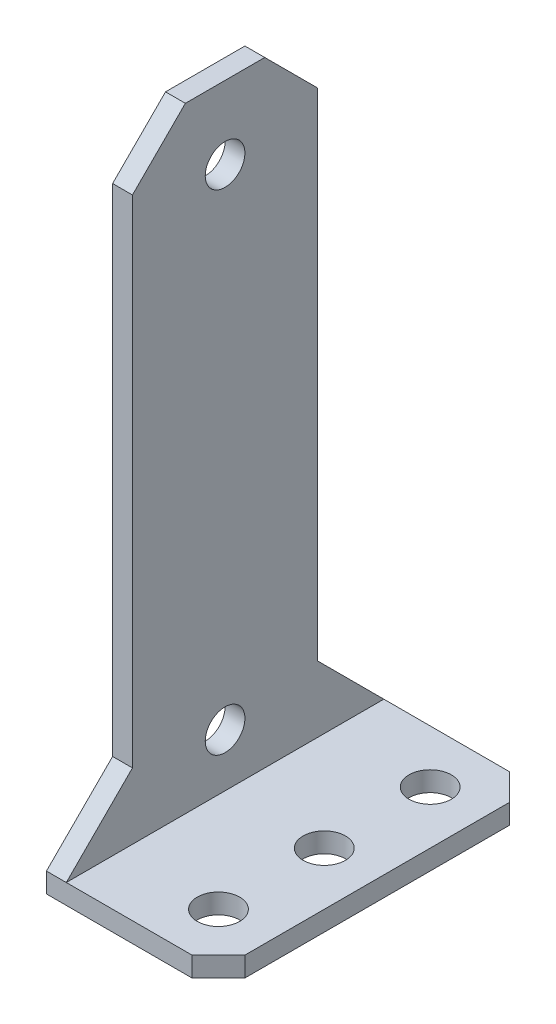
ISO-10303-21;
HEADER;
FILE_DESCRIPTION(('STEP AP214'),'2;1');
FILE_NAME('part.step','',(''),(''),'','','');
FILE_SCHEMA(('AUTOMOTIVE_DESIGN { 1 0 10303 214 1 1 1 1 }'));
ENDSEC;
DATA;
#1=APPLICATION_CONTEXT('core data for automotive mechanical design processes');
#2=APPLICATION_PROTOCOL_DEFINITION('international standard','automotive_design',2000,#1);
#3=PRODUCT_CONTEXT('',#1,'mechanical');
#4=PRODUCT('Part','Part','',(#3));
#5=PRODUCT_RELATED_PRODUCT_CATEGORY('part','',(#4));
#6=PRODUCT_DEFINITION_FORMATION('','',#4);
#7=PRODUCT_DEFINITION_CONTEXT('part definition',#1,'design');
#8=PRODUCT_DEFINITION('design','',#6,#7);
#9=PRODUCT_DEFINITION_SHAPE('','',#8);
#10=(LENGTH_UNIT() NAMED_UNIT(*) SI_UNIT(.MILLI.,.METRE.));
#11=(NAMED_UNIT(*) PLANE_ANGLE_UNIT() SI_UNIT($,.RADIAN.));
#12=(NAMED_UNIT(*) SI_UNIT($,.STERADIAN.) SOLID_ANGLE_UNIT());
#13=UNCERTAINTY_MEASURE_WITH_UNIT(LENGTH_MEASURE(1.E-05),#10,'distance_accuracy_value','');
#14=(GEOMETRIC_REPRESENTATION_CONTEXT(3) GLOBAL_UNCERTAINTY_ASSIGNED_CONTEXT((#13)) GLOBAL_UNIT_ASSIGNED_CONTEXT((#10,
#11,#12)) REPRESENTATION_CONTEXT('',''));
#15=CARTESIAN_POINT('',(0.,0.,0.));
#16=DIRECTION('',(0.,0.,1.));
#17=DIRECTION('',(1.,0.,0.));
#18=AXIS2_PLACEMENT_3D('',#15,#16,#17);
#19=CARTESIAN_POINT('',(1.5,48.,12.));
#20=DIRECTION('',(-1.,0.,0.));
#21=DIRECTION('',(0.,0.,1.));
#22=AXIS2_PLACEMENT_3D('',#19,#20,#21);
#23=PLANE('',#22);
#24=CARTESIAN_POINT('',(1.5,42.5,0.));
#25=DIRECTION('',(-1.,0.,0.));
#26=DIRECTION('',(0.,0.,1.));
#27=AXIS2_PLACEMENT_3D('',#24,#25,#26);
#28=CIRCLE('',#27,1.5);
#29=CARTESIAN_POINT('',(1.5,42.5,1.5));
#30=VERTEX_POINT('',#29);
#31=EDGE_CURVE('E315',#30,#30,#28,.T.);
#32=ORIENTED_EDGE('',*,*,#31,.T.);
#33=EDGE_LOOP('',(#32));
#34=FACE_BOUND('',#33,.T.);
#35=CARTESIAN_POINT('',(1.5,5.50000000000001,0.));
#36=DIRECTION('',(-1.,0.,0.));
#37=DIRECTION('',(0.,0.,1.));
#38=AXIS2_PLACEMENT_3D('',#35,#36,#37);
#39=CIRCLE('',#38,1.5);
#40=CARTESIAN_POINT('',(1.5,5.50000000000001,1.50000000000001));
#41=VERTEX_POINT('',#40);
#42=EDGE_CURVE('E310',#41,#41,#39,.T.);
#43=ORIENTED_EDGE('',*,*,#42,.T.);
#44=EDGE_LOOP('',(#43));
#45=FACE_BOUND('',#44,.T.);
#46=DIRECTION('',(0.,0.,-1.));
#47=VECTOR('',#46,1.);
#48=CARTESIAN_POINT('',(1.5,48.,12.));
#49=LINE('',#48,#47);
#50=CARTESIAN_POINT('',(1.5,48.,3.));
#51=VERTEX_POINT('',#50);
#52=CARTESIAN_POINT('',(1.5,48.,-3.));
#53=VERTEX_POINT('',#52);
#54=EDGE_CURVE('E158',#51,#53,#49,.T.);
#55=ORIENTED_EDGE('',*,*,#54,.F.);
#56=DIRECTION('',(0.,0.707106781186549,-0.707106781186546));
#57=VECTOR('',#56,1.);
#58=CARTESIAN_POINT('',(1.5,48.,3.));
#59=LINE('',#58,#57);
#60=CARTESIAN_POINT('',(1.5,44.,7.));
#61=VERTEX_POINT('',#60);
#62=EDGE_CURVE('E194',#51,#61,#59,.F.);
#63=ORIENTED_EDGE('',*,*,#62,.T.);
#64=DIRECTION('',(0.,-1.,0.));
#65=VECTOR('',#64,1.);
#66=CARTESIAN_POINT('',(1.5,48.,7.));
#67=LINE('',#66,#65);
#68=CARTESIAN_POINT('',(1.5,6.49999999999998,7.));
#69=VERTEX_POINT('',#68);
#70=EDGE_CURVE('E218',#61,#69,#67,.T.);
#71=ORIENTED_EDGE('',*,*,#70,.T.);
#72=DIRECTION('',(0.,0.707106781186544,-0.707106781186551));
#73=VECTOR('',#72,1.);
#74=CARTESIAN_POINT('',(1.5,24.7499999999998,-11.25));
#75=LINE('',#74,#73);
#76=CARTESIAN_POINT('',(1.5,1.5,12.));
#77=VERTEX_POINT('',#76);
#78=EDGE_CURVE('E134',#69,#77,#75,.F.);
#79=ORIENTED_EDGE('',*,*,#78,.T.);
#80=DIRECTION('',(0.,0.,-1.));
#81=VECTOR('',#80,1.);
#82=CARTESIAN_POINT('',(1.5,1.5,12.));
#83=LINE('',#82,#81);
#84=CARTESIAN_POINT('',(1.5,1.5,-12.));
#85=VERTEX_POINT('',#84);
#86=EDGE_CURVE('E161',#77,#85,#83,.T.);
#87=ORIENTED_EDGE('',*,*,#86,.T.);
#88=DIRECTION('',(0.,0.707106781186551,0.707106781186544));
#89=VECTOR('',#88,1.);
#90=CARTESIAN_POINT('',(1.5,36.7500000000002,23.2499999999999));
#91=LINE('',#90,#89);
#92=CARTESIAN_POINT('',(1.5,6.50000000000003,-7.));
#93=VERTEX_POINT('',#92);
#94=EDGE_CURVE('E11',#85,#93,#91,.T.);
#95=ORIENTED_EDGE('',*,*,#94,.T.);
#96=DIRECTION('',(0.,-1.,0.));
#97=VECTOR('',#96,1.);
#98=CARTESIAN_POINT('',(1.5,48.,-7.));
#99=LINE('',#98,#97);
#100=CARTESIAN_POINT('',(1.5,44.,-7.));
#101=VERTEX_POINT('',#100);
#102=EDGE_CURVE('E321',#101,#93,#99,.T.);
#103=ORIENTED_EDGE('',*,*,#102,.F.);
#104=DIRECTION('',(0.,0.707106781186547,0.707106781186548));
#105=VECTOR('',#104,1.);
#106=CARTESIAN_POINT('',(1.5,44.,-7.));
#107=LINE('',#106,#105);
#108=EDGE_CURVE('E192',#101,#53,#107,.T.);
#109=ORIENTED_EDGE('',*,*,#108,.T.);
#110=EDGE_LOOP('',(#55,#63,#71,#79,#87,#95,#103,#109));
#111=FACE_BOUND('',#110,.T.);
#112=ADVANCED_FACE('F33',(#34,#45,#111),#23,.F.);
#113=CARTESIAN_POINT('',(0.,48.,12.));
#114=DIRECTION('',(0.,-1.,0.));
#115=DIRECTION('',(0.,0.,-1.));
#116=AXIS2_PLACEMENT_3D('',#113,#114,#115);
#117=PLANE('',#116);
#118=DIRECTION('',(0.,0.,-1.));
#119=VECTOR('',#118,1.);
#120=CARTESIAN_POINT('',(0.,48.,12.));
#121=LINE('',#120,#119);
#122=CARTESIAN_POINT('',(0.,48.,3.));
#123=VERTEX_POINT('',#122);
#124=CARTESIAN_POINT('',(0.,48.,-3.));
#125=VERTEX_POINT('',#124);
#126=EDGE_CURVE('E154',#123,#125,#121,.T.);
#127=ORIENTED_EDGE('',*,*,#126,.F.);
#128=DIRECTION('',(1.,0.,0.));
#129=VECTOR('',#128,1.);
#130=CARTESIAN_POINT('',(0.,48.,3.));
#131=LINE('',#130,#129);
#132=EDGE_CURVE('E189',#123,#51,#131,.T.);
#133=ORIENTED_EDGE('',*,*,#132,.T.);
#134=ORIENTED_EDGE('',*,*,#54,.T.);
#135=DIRECTION('',(-1.,0.,0.));
#136=VECTOR('',#135,1.);
#137=CARTESIAN_POINT('',(0.,48.,-3.));
#138=LINE('',#137,#136);
#139=EDGE_CURVE('E187',#53,#125,#138,.T.);
#140=ORIENTED_EDGE('',*,*,#139,.T.);
#141=EDGE_LOOP('',(#127,#133,#134,#140));
#142=FACE_BOUND('',#141,.T.);
#143=ADVANCED_FACE('F267',(#142),#117,.F.);
#144=CARTESIAN_POINT('',(0.,0.,12.));
#145=DIRECTION('',(1.,0.,0.));
#146=DIRECTION('',(0.,0.,-1.));
#147=AXIS2_PLACEMENT_3D('',#144,#145,#146);
#148=PLANE('',#147);
#149=CARTESIAN_POINT('',(0.,42.5,0.));
#150=DIRECTION('',(-1.,0.,0.));
#151=DIRECTION('',(0.,0.,1.));
#152=AXIS2_PLACEMENT_3D('',#149,#150,#151);
#153=CIRCLE('',#152,1.5);
#154=CARTESIAN_POINT('',(0.,42.5,1.5));
#155=VERTEX_POINT('',#154);
#156=EDGE_CURVE('E318',#155,#155,#153,.T.);
#157=ORIENTED_EDGE('',*,*,#156,.F.);
#158=EDGE_LOOP('',(#157));
#159=FACE_BOUND('',#158,.T.);
#160=CARTESIAN_POINT('',(0.,5.50000000000001,0.));
#161=DIRECTION('',(-1.,0.,0.));
#162=DIRECTION('',(0.,0.,1.));
#163=AXIS2_PLACEMENT_3D('',#160,#161,#162);
#164=CIRCLE('',#163,1.5);
#165=CARTESIAN_POINT('',(0.,5.50000000000001,1.50000000000001));
#166=VERTEX_POINT('',#165);
#167=EDGE_CURVE('E317',#166,#166,#164,.T.);
#168=ORIENTED_EDGE('',*,*,#167,.F.);
#169=EDGE_LOOP('',(#168));
#170=FACE_BOUND('',#169,.T.);
#171=DIRECTION('',(0.,-1.,0.));
#172=VECTOR('',#171,1.);
#173=CARTESIAN_POINT('',(0.,0.,12.));
#174=LINE('',#173,#172);
#175=CARTESIAN_POINT('',(0.,1.5,12.));
#176=VERTEX_POINT('',#175);
#177=CARTESIAN_POINT('',(0.,0.,12.));
#178=VERTEX_POINT('',#177);
#179=EDGE_CURVE('E155',#176,#178,#174,.T.);
#180=ORIENTED_EDGE('',*,*,#179,.F.);
#181=DIRECTION('',(0.,-0.707106781186544,0.707106781186551));
#182=VECTOR('',#181,1.);
#183=CARTESIAN_POINT('',(0.,0.750000000000024,12.75));
#184=LINE('',#183,#182);
#185=CARTESIAN_POINT('',(0.,6.49999999999998,6.99999999999998));
#186=VERTEX_POINT('',#185);
#187=EDGE_CURVE('E210',#176,#186,#184,.F.);
#188=ORIENTED_EDGE('',*,*,#187,.T.);
#189=DIRECTION('',(0.,1.,0.));
#190=VECTOR('',#189,1.);
#191=CARTESIAN_POINT('',(0.,42.5,7.));
#192=LINE('',#191,#190);
#193=CARTESIAN_POINT('',(0.,44.,7.));
#194=VERTEX_POINT('',#193);
#195=EDGE_CURVE('E326',#186,#194,#192,.T.);
#196=ORIENTED_EDGE('',*,*,#195,.T.);
#197=DIRECTION('',(0.,-0.707106781186549,0.707106781186546));
#198=VECTOR('',#197,1.);
#199=CARTESIAN_POINT('',(0.,48.,3.));
#200=LINE('',#199,#198);
#201=EDGE_CURVE('E201',#194,#123,#200,.F.);
#202=ORIENTED_EDGE('',*,*,#201,.T.);
#203=ORIENTED_EDGE('',*,*,#126,.T.);
#204=DIRECTION('',(0.,-0.707106781186547,-0.707106781186548));
#205=VECTOR('',#204,1.);
#206=CARTESIAN_POINT('',(0.,44.,-7.));
#207=LINE('',#206,#205);
#208=CARTESIAN_POINT('',(0.,44.,-7.));
#209=VERTEX_POINT('',#208);
#210=EDGE_CURVE('E199',#125,#209,#207,.T.);
#211=ORIENTED_EDGE('',*,*,#210,.T.);
#212=DIRECTION('',(0.,-1.,0.));
#213=VECTOR('',#212,1.);
#214=CARTESIAN_POINT('',(0.,0.,-7.));
#215=LINE('',#214,#213);
#216=CARTESIAN_POINT('',(0.,6.50000000000003,-7.));
#217=VERTEX_POINT('',#216);
#218=EDGE_CURVE('E133',#209,#217,#215,.T.);
#219=ORIENTED_EDGE('',*,*,#218,.T.);
#220=DIRECTION('',(0.,-0.707106781186551,-0.707106781186544));
#221=VECTOR('',#220,1.);
#222=CARTESIAN_POINT('',(0.,12.75,-0.750000000000119));
#223=LINE('',#222,#221);
#224=CARTESIAN_POINT('',(0.,1.5,-12.));
#225=VERTEX_POINT('',#224);
#226=EDGE_CURVE('E41',#217,#225,#223,.T.);
#227=ORIENTED_EDGE('',*,*,#226,.T.);
#228=DIRECTION('',(0.,-1.,0.));
#229=VECTOR('',#228,1.);
#230=CARTESIAN_POINT('',(0.,0.,-12.));
#231=LINE('',#230,#229);
#232=CARTESIAN_POINT('',(0.,0.,-12.));
#233=VERTEX_POINT('',#232);
#234=EDGE_CURVE('E130',#225,#233,#231,.T.);
#235=ORIENTED_EDGE('',*,*,#234,.T.);
#236=DIRECTION('',(0.,0.,-1.));
#237=VECTOR('',#236,1.);
#238=CARTESIAN_POINT('',(0.,0.,12.));
#239=LINE('',#238,#237);
#240=EDGE_CURVE('E152',#178,#233,#239,.T.);
#241=ORIENTED_EDGE('',*,*,#240,.F.);
#242=EDGE_LOOP('',(#180,#188,#196,#202,#203,#211,#219,#227,#235,#241));
#243=FACE_BOUND('',#242,.T.);
#244=ADVANCED_FACE('F128',(#159,#170,#243),#148,.F.);
#245=CARTESIAN_POINT('',(0.,0.,-12.));
#246=DIRECTION('',(0.,0.,1.));
#247=DIRECTION('',(1.,0.,0.));
#248=AXIS2_PLACEMENT_3D('',#245,#246,#247);
#249=PLANE('',#248);
#250=ORIENTED_EDGE('',*,*,#234,.F.);
#251=DIRECTION('',(-1.,0.,0.));
#252=VECTOR('',#251,1.);
#253=CARTESIAN_POINT('',(13.,1.5,-12.));
#254=LINE('',#253,#252);
#255=EDGE_CURVE('E140',#85,#225,#254,.T.);
#256=ORIENTED_EDGE('',*,*,#255,.F.);
#257=CARTESIAN_POINT('',(11.,1.5,-12.));
#258=VERTEX_POINT('',#257);
#259=EDGE_CURVE('E145',#258,#85,#254,.T.);
#260=ORIENTED_EDGE('',*,*,#259,.F.);
#261=DIRECTION('',(0.,-1.,0.));
#262=VECTOR('',#261,1.);
#263=CARTESIAN_POINT('',(11.,0.,-12.));
#264=LINE('',#263,#262);
#265=CARTESIAN_POINT('',(11.,0.,-12.));
#266=VERTEX_POINT('',#265);
#267=EDGE_CURVE('E178',#258,#266,#264,.T.);
#268=ORIENTED_EDGE('',*,*,#267,.T.);
#269=DIRECTION('',(1.,0.,0.));
#270=VECTOR('',#269,1.);
#271=CARTESIAN_POINT('',(0.,0.,-12.));
#272=LINE('',#271,#270);
#273=EDGE_CURVE('E143',#233,#266,#272,.T.);
#274=ORIENTED_EDGE('',*,*,#273,.F.);
#275=EDGE_LOOP('',(#250,#256,#260,#268,#274));
#276=FACE_BOUND('',#275,.T.);
#277=ADVANCED_FACE('F138',(#276),#249,.F.);
#278=CARTESIAN_POINT('',(0.,0.,12.));
#279=DIRECTION('',(0.,1.,0.));
#280=DIRECTION('',(0.,0.,1.));
#281=AXIS2_PLACEMENT_3D('',#278,#279,#280);
#282=PLANE('',#281);
#283=CARTESIAN_POINT('',(9.,0.,-8.));
#284=DIRECTION('',(0.,1.,0.));
#285=DIRECTION('',(0.,0.,1.));
#286=AXIS2_PLACEMENT_3D('',#283,#284,#285);
#287=CIRCLE('',#286,1.6);
#288=CARTESIAN_POINT('',(9.,0.,-6.4));
#289=VERTEX_POINT('',#288);
#290=EDGE_CURVE('E148',#289,#289,#287,.T.);
#291=ORIENTED_EDGE('',*,*,#290,.T.);
#292=EDGE_LOOP('',(#291));
#293=FACE_BOUND('',#292,.T.);
#294=CARTESIAN_POINT('',(9.,0.,8.));
#295=DIRECTION('',(0.,1.,0.));
#296=DIRECTION('',(0.,0.,1.));
#297=AXIS2_PLACEMENT_3D('',#294,#295,#296);
#298=CIRCLE('',#297,1.6);
#299=CARTESIAN_POINT('',(9.,0.,9.6));
#300=VERTEX_POINT('',#299);
#301=EDGE_CURVE('E295',#300,#300,#298,.T.);
#302=ORIENTED_EDGE('',*,*,#301,.T.);
#303=EDGE_LOOP('',(#302));
#304=FACE_BOUND('',#303,.T.);
#305=CARTESIAN_POINT('',(9.,0.,0.));
#306=DIRECTION('',(0.,1.,0.));
#307=DIRECTION('',(0.,0.,1.));
#308=AXIS2_PLACEMENT_3D('',#305,#306,#307);
#309=CIRCLE('',#308,1.6);
#310=CARTESIAN_POINT('',(9.,0.,1.6));
#311=VERTEX_POINT('',#310);
#312=EDGE_CURVE('E298',#311,#311,#309,.T.);
#313=ORIENTED_EDGE('',*,*,#312,.T.);
#314=EDGE_LOOP('',(#313));
#315=FACE_BOUND('',#314,.T.);
#316=ORIENTED_EDGE('',*,*,#273,.T.);
#317=DIRECTION('',(-0.707106781186548,0.,-0.707106781186548));
#318=VECTOR('',#317,1.);
#319=CARTESIAN_POINT('',(13.,0.,-10.));
#320=LINE('',#319,#318);
#321=CARTESIAN_POINT('',(13.,0.,-10.));
#322=VERTEX_POINT('',#321);
#323=EDGE_CURVE('E182',#266,#322,#320,.F.);
#324=ORIENTED_EDGE('',*,*,#323,.T.);
#325=DIRECTION('',(0.,0.,-1.));
#326=VECTOR('',#325,1.);
#327=CARTESIAN_POINT('',(13.,0.,12.));
#328=LINE('',#327,#326);
#329=CARTESIAN_POINT('',(13.,0.,10.));
#330=VERTEX_POINT('',#329);
#331=EDGE_CURVE('E166',#330,#322,#328,.T.);
#332=ORIENTED_EDGE('',*,*,#331,.F.);
#333=DIRECTION('',(-0.707106781186548,0.,0.707106781186548));
#334=VECTOR('',#333,1.);
#335=CARTESIAN_POINT('',(11.,0.,12.));
#336=LINE('',#335,#334);
#337=CARTESIAN_POINT('',(11.,0.,12.));
#338=VERTEX_POINT('',#337);
#339=EDGE_CURVE('E180',#330,#338,#336,.T.);
#340=ORIENTED_EDGE('',*,*,#339,.T.);
#341=DIRECTION('',(1.,0.,0.));
#342=VECTOR('',#341,1.);
#343=CARTESIAN_POINT('',(0.,0.,12.));
#344=LINE('',#343,#342);
#345=EDGE_CURVE('E144',#178,#338,#344,.T.);
#346=ORIENTED_EDGE('',*,*,#345,.F.);
#347=ORIENTED_EDGE('',*,*,#240,.T.);
#348=EDGE_LOOP('',(#316,#324,#332,#340,#346,#347));
#349=FACE_BOUND('',#348,.T.);
#350=ADVANCED_FACE('F237',(#293,#304,#315,#349),#282,.F.);
#351=CARTESIAN_POINT('',(13.,0.,12.));
#352=DIRECTION('',(-1.,0.,0.));
#353=DIRECTION('',(0.,0.,1.));
#354=AXIS2_PLACEMENT_3D('',#351,#352,#353);
#355=PLANE('',#354);
#356=ORIENTED_EDGE('',*,*,#331,.T.);
#357=DIRECTION('',(0.,1.,0.));
#358=VECTOR('',#357,1.);
#359=CARTESIAN_POINT('',(13.,0.,-10.));
#360=LINE('',#359,#358);
#361=CARTESIAN_POINT('',(13.,1.5,-10.));
#362=VERTEX_POINT('',#361);
#363=EDGE_CURVE('E171',#322,#362,#360,.T.);
#364=ORIENTED_EDGE('',*,*,#363,.T.);
#365=DIRECTION('',(0.,0.,-1.));
#366=VECTOR('',#365,1.);
#367=CARTESIAN_POINT('',(13.,1.5,12.));
#368=LINE('',#367,#366);
#369=CARTESIAN_POINT('',(13.,1.5,10.));
#370=VERTEX_POINT('',#369);
#371=EDGE_CURVE('E163',#370,#362,#368,.T.);
#372=ORIENTED_EDGE('',*,*,#371,.F.);
#373=DIRECTION('',(0.,-1.,0.));
#374=VECTOR('',#373,1.);
#375=CARTESIAN_POINT('',(13.,0.,10.));
#376=LINE('',#375,#374);
#377=EDGE_CURVE('E169',#370,#330,#376,.T.);
#378=ORIENTED_EDGE('',*,*,#377,.T.);
#379=EDGE_LOOP('',(#356,#364,#372,#378));
#380=FACE_BOUND('',#379,.T.);
#381=ADVANCED_FACE('F247',(#380),#355,.F.);
#382=CARTESIAN_POINT('',(13.,1.5,12.));
#383=DIRECTION('',(0.,-1.,0.));
#384=DIRECTION('',(0.,0.,-1.));
#385=AXIS2_PLACEMENT_3D('',#382,#383,#384);
#386=PLANE('',#385);
#387=CARTESIAN_POINT('',(9.,1.5,-8.));
#388=DIRECTION('',(0.,1.,0.));
#389=DIRECTION('',(0.,0.,1.));
#390=AXIS2_PLACEMENT_3D('',#387,#388,#389);
#391=CIRCLE('',#390,1.6);
#392=CARTESIAN_POINT('',(9.,1.5,-6.4));
#393=VERTEX_POINT('',#392);
#394=EDGE_CURVE('E307',#393,#393,#391,.T.);
#395=ORIENTED_EDGE('',*,*,#394,.F.);
#396=EDGE_LOOP('',(#395));
#397=FACE_BOUND('',#396,.T.);
#398=CARTESIAN_POINT('',(9.,1.5,8.));
#399=DIRECTION('',(0.,1.,0.));
#400=DIRECTION('',(0.,0.,1.));
#401=AXIS2_PLACEMENT_3D('',#398,#399,#400);
#402=CIRCLE('',#401,1.6);
#403=CARTESIAN_POINT('',(9.,1.5,9.6));
#404=VERTEX_POINT('',#403);
#405=EDGE_CURVE('E304',#404,#404,#402,.T.);
#406=ORIENTED_EDGE('',*,*,#405,.F.);
#407=EDGE_LOOP('',(#406));
#408=FACE_BOUND('',#407,.T.);
#409=ORIENTED_EDGE('',*,*,#86,.F.);
#410=DIRECTION('',(-1.,0.,0.));
#411=VECTOR('',#410,1.);
#412=CARTESIAN_POINT('',(13.,1.5,12.));
#413=LINE('',#412,#411);
#414=CARTESIAN_POINT('',(11.,1.5,12.));
#415=VERTEX_POINT('',#414);
#416=EDGE_CURVE('E225',#415,#77,#413,.T.);
#417=ORIENTED_EDGE('',*,*,#416,.F.);
#418=DIRECTION('',(0.707106781186548,0.,-0.707106781186548));
#419=VECTOR('',#418,1.);
#420=CARTESIAN_POINT('',(11.,1.5,12.));
#421=LINE('',#420,#419);
#422=EDGE_CURVE('E174',#415,#370,#421,.T.);
#423=ORIENTED_EDGE('',*,*,#422,.T.);
#424=ORIENTED_EDGE('',*,*,#371,.T.);
#425=DIRECTION('',(0.707106781186548,0.,0.707106781186548));
#426=VECTOR('',#425,1.);
#427=CARTESIAN_POINT('',(13.,1.5,-10.));
#428=LINE('',#427,#426);
#429=EDGE_CURVE('E176',#362,#258,#428,.F.);
#430=ORIENTED_EDGE('',*,*,#429,.T.);
#431=ORIENTED_EDGE('',*,*,#259,.T.);
#432=EDGE_LOOP('',(#409,#417,#423,#424,#430,#431));
#433=FACE_BOUND('',#432,.T.);
#434=CARTESIAN_POINT('',(9.,1.5,0.));
#435=DIRECTION('',(0.,1.,0.));
#436=DIRECTION('',(0.,0.,1.));
#437=AXIS2_PLACEMENT_3D('',#434,#435,#436);
#438=CIRCLE('',#437,1.6);
#439=CARTESIAN_POINT('',(9.,1.5,1.6));
#440=VERTEX_POINT('',#439);
#441=EDGE_CURVE('E300',#440,#440,#438,.T.);
#442=ORIENTED_EDGE('',*,*,#441,.F.);
#443=EDGE_LOOP('',(#442));
#444=FACE_BOUND('',#443,.T.);
#445=ADVANCED_FACE('F244',(#397,#408,#433,#444),#386,.F.);
#446=CARTESIAN_POINT('',(0.,0.,12.));
#447=DIRECTION('',(0.,0.,1.));
#448=DIRECTION('',(1.,0.,0.));
#449=AXIS2_PLACEMENT_3D('',#446,#447,#448);
#450=PLANE('',#449);
#451=ORIENTED_EDGE('',*,*,#416,.T.);
#452=EDGE_CURVE('E227',#77,#176,#413,.T.);
#453=ORIENTED_EDGE('',*,*,#452,.T.);
#454=ORIENTED_EDGE('',*,*,#179,.T.);
#455=ORIENTED_EDGE('',*,*,#345,.T.);
#456=DIRECTION('',(0.,1.,0.));
#457=VECTOR('',#456,1.);
#458=CARTESIAN_POINT('',(11.,1.5,12.));
#459=LINE('',#458,#457);
#460=EDGE_CURVE('E184',#338,#415,#459,.T.);
#461=ORIENTED_EDGE('',*,*,#460,.T.);
#462=EDGE_LOOP('',(#451,#453,#454,#455,#461));
#463=FACE_BOUND('',#462,.T.);
#464=ADVANCED_FACE('F226',(#463),#450,.T.);
#465=CARTESIAN_POINT('',(9.,-43.7,0.));
#466=DIRECTION('',(0.,1.,0.));
#467=DIRECTION('',(0.,0.,1.));
#468=AXIS2_PLACEMENT_3D('',#465,#466,#467);
#469=CYLINDRICAL_SURFACE('',#468,1.6);
#470=ORIENTED_EDGE('',*,*,#441,.T.);
#471=EDGE_LOOP('',(#470));
#472=FACE_BOUND('',#471,.T.);
#473=ORIENTED_EDGE('',*,*,#312,.F.);
#474=EDGE_LOOP('',(#473));
#475=FACE_BOUND('',#474,.T.);
#476=ADVANCED_FACE('F359',(#472,#475),#469,.F.);
#477=CARTESIAN_POINT('',(9.,-43.7,8.));
#478=DIRECTION('',(0.,1.,0.));
#479=DIRECTION('',(0.,0.,1.));
#480=AXIS2_PLACEMENT_3D('',#477,#478,#479);
#481=CYLINDRICAL_SURFACE('',#480,1.6);
#482=ORIENTED_EDGE('',*,*,#405,.T.);
#483=EDGE_LOOP('',(#482));
#484=FACE_BOUND('',#483,.T.);
#485=ORIENTED_EDGE('',*,*,#301,.F.);
#486=EDGE_LOOP('',(#485));
#487=FACE_BOUND('',#486,.T.);
#488=ADVANCED_FACE('F262',(#484,#487),#481,.F.);
#489=CARTESIAN_POINT('',(9.,-43.7,-8.));
#490=DIRECTION('',(0.,1.,0.));
#491=DIRECTION('',(0.,0.,1.));
#492=AXIS2_PLACEMENT_3D('',#489,#490,#491);
#493=CYLINDRICAL_SURFACE('',#492,1.6);
#494=ORIENTED_EDGE('',*,*,#394,.T.);
#495=EDGE_LOOP('',(#494));
#496=FACE_BOUND('',#495,.T.);
#497=ORIENTED_EDGE('',*,*,#290,.F.);
#498=EDGE_LOOP('',(#497));
#499=FACE_BOUND('',#498,.T.);
#500=ADVANCED_FACE('F254',(#496,#499),#493,.F.);
#501=CARTESIAN_POINT('',(13.,0.,-10.));
#502=DIRECTION('',(-0.707106781186547,0.,0.707106781186547));
#503=DIRECTION('',(0.,1.,0.));
#504=AXIS2_PLACEMENT_3D('',#501,#502,#503);
#505=PLANE('',#504);
#506=ORIENTED_EDGE('',*,*,#323,.F.);
#507=ORIENTED_EDGE('',*,*,#267,.F.);
#508=ORIENTED_EDGE('',*,*,#429,.F.);
#509=ORIENTED_EDGE('',*,*,#363,.F.);
#510=EDGE_LOOP('',(#506,#507,#508,#509));
#511=FACE_BOUND('',#510,.T.);
#512=ADVANCED_FACE('F251',(#511),#505,.F.);
#513=CARTESIAN_POINT('',(11.,0.,12.));
#514=DIRECTION('',(0.707106781186547,0.,0.707106781186547));
#515=DIRECTION('',(0.,-1.,0.));
#516=AXIS2_PLACEMENT_3D('',#513,#514,#515);
#517=PLANE('',#516);
#518=ORIENTED_EDGE('',*,*,#339,.F.);
#519=ORIENTED_EDGE('',*,*,#377,.F.);
#520=ORIENTED_EDGE('',*,*,#422,.F.);
#521=ORIENTED_EDGE('',*,*,#460,.F.);
#522=EDGE_LOOP('',(#518,#519,#520,#521));
#523=FACE_BOUND('',#522,.T.);
#524=ADVANCED_FACE('F242',(#523),#517,.T.);
#525=CARTESIAN_POINT('',(13.,42.5,0.));
#526=DIRECTION('',(-1.,0.,0.));
#527=DIRECTION('',(0.,0.,1.));
#528=AXIS2_PLACEMENT_3D('',#525,#526,#527);
#529=CYLINDRICAL_SURFACE('',#528,1.5);
#530=CARTESIAN_POINT('',(0.,42.5,1.5));
#531=CARTESIAN_POINT('',(0.015625,42.5,1.5));
#532=CARTESIAN_POINT('',(0.03125,42.5,1.5));
#533=CARTESIAN_POINT('',(0.0625000000000001,42.5,1.5));
#534=CARTESIAN_POINT('',(0.0781250000000001,42.5,1.5));
#535=CARTESIAN_POINT('',(0.109375,42.5,1.5));
#536=CARTESIAN_POINT('',(0.125,42.5,1.5));
#537=CARTESIAN_POINT('',(0.15625,42.5,1.5));
#538=CARTESIAN_POINT('',(0.171875,42.5,1.5));
#539=CARTESIAN_POINT('',(0.203125,42.5,1.5));
#540=CARTESIAN_POINT('',(0.21875,42.5,1.5));
#541=CARTESIAN_POINT('',(0.25,42.5,1.5));
#542=CARTESIAN_POINT('',(0.265625,42.5,1.5));
#543=CARTESIAN_POINT('',(0.296875,42.5,1.5));
#544=CARTESIAN_POINT('',(0.3125,42.5,1.5));
#545=CARTESIAN_POINT('',(0.34375,42.5,1.5));
#546=CARTESIAN_POINT('',(0.359375,42.5,1.5));
#547=CARTESIAN_POINT('',(0.390625,42.5,1.5));
#548=CARTESIAN_POINT('',(0.40625,42.5,1.5));
#549=CARTESIAN_POINT('',(0.4375,42.5,1.5));
#550=CARTESIAN_POINT('',(0.453125,42.5,1.5));
#551=CARTESIAN_POINT('',(0.484375,42.5,1.5));
#552=CARTESIAN_POINT('',(0.5,42.5,1.5));
#553=CARTESIAN_POINT('',(0.53125,42.5,1.5));
#554=CARTESIAN_POINT('',(0.546875,42.5,1.5));
#555=CARTESIAN_POINT('',(0.578125000000001,42.5,1.5));
#556=CARTESIAN_POINT('',(0.593750000000001,42.5,1.5));
#557=CARTESIAN_POINT('',(0.625000000000001,42.5,1.5));
#558=CARTESIAN_POINT('',(0.640625000000001,42.5,1.5));
#559=CARTESIAN_POINT('',(0.671875000000001,42.5,1.5));
#560=CARTESIAN_POINT('',(0.687500000000001,42.5,1.5));
#561=CARTESIAN_POINT('',(0.718750000000001,42.5,1.5));
#562=CARTESIAN_POINT('',(0.734375000000001,42.5,1.5));
#563=CARTESIAN_POINT('',(0.765625000000001,42.5,1.5));
#564=CARTESIAN_POINT('',(0.781250000000001,42.5,1.5));
#565=CARTESIAN_POINT('',(0.812500000000001,42.5,1.5));
#566=CARTESIAN_POINT('',(0.828125000000001,42.5,1.5));
#567=CARTESIAN_POINT('',(0.859375000000001,42.5,1.5));
#568=CARTESIAN_POINT('',(0.875000000000001,42.5,1.5));
#569=CARTESIAN_POINT('',(0.906250000000001,42.5,1.5));
#570=CARTESIAN_POINT('',(0.921875000000001,42.5,1.5));
#571=CARTESIAN_POINT('',(0.953125000000001,42.5,1.5));
#572=CARTESIAN_POINT('',(0.968750000000001,42.5,1.5));
#573=CARTESIAN_POINT('',(1.,42.5,1.5));
#574=CARTESIAN_POINT('',(1.015625,42.5,1.5));
#575=CARTESIAN_POINT('',(1.046875,42.5,1.5));
#576=CARTESIAN_POINT('',(1.0625,42.5,1.5));
#577=CARTESIAN_POINT('',(1.09375,42.5,1.5));
#578=CARTESIAN_POINT('',(1.109375,42.5,1.5));
#579=CARTESIAN_POINT('',(1.140625,42.5,1.5));
#580=CARTESIAN_POINT('',(1.15625,42.5,1.5));
#581=CARTESIAN_POINT('',(1.1875,42.5,1.5));
#582=CARTESIAN_POINT('',(1.203125,42.5,1.5));
#583=CARTESIAN_POINT('',(1.234375,42.5,1.5));
#584=CARTESIAN_POINT('',(1.25,42.5,1.5));
#585=CARTESIAN_POINT('',(1.28125,42.5,1.5));
#586=CARTESIAN_POINT('',(1.296875,42.5,1.5));
#587=CARTESIAN_POINT('',(1.328125,42.5,1.5));
#588=CARTESIAN_POINT('',(1.34375,42.5,1.5));
#589=CARTESIAN_POINT('',(1.375,42.5,1.5));
#590=CARTESIAN_POINT('',(1.390625,42.5,1.5));
#591=CARTESIAN_POINT('',(1.421875,42.5,1.5));
#592=CARTESIAN_POINT('',(1.4375,42.5,1.5));
#593=CARTESIAN_POINT('',(1.46875,42.5,1.5));
#594=CARTESIAN_POINT('',(1.484375,42.5,1.5));
#595=CARTESIAN_POINT('',(1.5,42.5,1.5));
#596=B_SPLINE_CURVE_WITH_KNOTS('',3,(#530,#531,#532,#533,#534,#535,#536,#537,#538,#539,#540,
#541,#542,#543,#544,#545,#546,#547,#548,#549,#550,#551,#552,#553,#554,#555,#556,#557,#558,#559,
#560,#561,#562,#563,#564,#565,#566,#567,#568,#569,#570,#571,#572,#573,#574,#575,#576,#577,#578,
#579,#580,#581,#582,#583,#584,#585,#586,#587,#588,#589,#590,#591,#592,#593,#594,#595),
.UNSPECIFIED.,.F.,.F.,(4,2,2,2,2,2,2,2,2,2,2,2,2,2,2,2,2,2,2,2,2,2,2,2,2,2,2,2,2,2,2,2,4),(0.,
0.046875,0.0937500000000001,0.140625,0.1875,0.234375,0.28125,0.328125,0.375,0.421875,0.46875,
0.515625,0.5625,0.609375000000001,0.656250000000001,0.703125000000001,0.750000000000001,
0.796875000000001,0.843750000000001,0.890625000000001,0.937500000000001,0.984375000000001,
1.03125,1.078125,1.125,1.171875,1.21875,1.265625,1.3125,1.359375,1.40625,1.453125,1.5),.UNSPECIFIED.);
#597=EDGE_CURVE('BSEAM260',#155,#30,#596,.T.);
#598=ORIENTED_EDGE('',*,*,#156,.T.);
#599=ORIENTED_EDGE('',*,*,#31,.F.);
#600=ORIENTED_EDGE('',*,*,#597,.T.);
#601=ORIENTED_EDGE('',*,*,#597,.F.);
#602=EDGE_LOOP('',(#598,#600,#599,#601));
#603=FACE_BOUND('',#602,.T.);
#604=ADVANCED_FACE('F260',(#603),#529,.F.);
#605=CARTESIAN_POINT('',(13.,5.50000000000001,0.));
#606=DIRECTION('',(-1.,0.,0.));
#607=DIRECTION('',(0.,0.,1.));
#608=AXIS2_PLACEMENT_3D('',#605,#606,#607);
#609=CYLINDRICAL_SURFACE('',#608,1.5);
#610=CARTESIAN_POINT('',(0.,5.50000000000001,1.50000000000001));
#611=CARTESIAN_POINT('',(0.015625,5.50000000000001,1.50000000000001));
#612=CARTESIAN_POINT('',(0.03125,5.50000000000001,1.50000000000001));
#613=CARTESIAN_POINT('',(0.0625000000000001,5.50000000000001,1.50000000000001));
#614=CARTESIAN_POINT('',(0.0781250000000001,5.50000000000001,1.50000000000001));
#615=CARTESIAN_POINT('',(0.109375,5.50000000000001,1.50000000000001));
#616=CARTESIAN_POINT('',(0.125,5.50000000000001,1.50000000000001));
#617=CARTESIAN_POINT('',(0.15625,5.50000000000001,1.50000000000001));
#618=CARTESIAN_POINT('',(0.171875,5.50000000000001,1.50000000000001));
#619=CARTESIAN_POINT('',(0.203125,5.50000000000001,1.50000000000001));
#620=CARTESIAN_POINT('',(0.21875,5.50000000000001,1.50000000000001));
#621=CARTESIAN_POINT('',(0.25,5.50000000000001,1.50000000000001));
#622=CARTESIAN_POINT('',(0.265625,5.50000000000001,1.50000000000001));
#623=CARTESIAN_POINT('',(0.296875,5.50000000000001,1.50000000000001));
#624=CARTESIAN_POINT('',(0.3125,5.50000000000001,1.50000000000001));
#625=CARTESIAN_POINT('',(0.34375,5.50000000000001,1.50000000000001));
#626=CARTESIAN_POINT('',(0.359375,5.50000000000001,1.50000000000001));
#627=CARTESIAN_POINT('',(0.390625,5.50000000000001,1.50000000000001));
#628=CARTESIAN_POINT('',(0.40625,5.50000000000001,1.50000000000001));
#629=CARTESIAN_POINT('',(0.4375,5.50000000000001,1.50000000000001));
#630=CARTESIAN_POINT('',(0.453125,5.50000000000001,1.50000000000001));
#631=CARTESIAN_POINT('',(0.484375,5.50000000000001,1.50000000000001));
#632=CARTESIAN_POINT('',(0.5,5.50000000000001,1.50000000000001));
#633=CARTESIAN_POINT('',(0.53125,5.50000000000001,1.50000000000001));
#634=CARTESIAN_POINT('',(0.546875,5.50000000000001,1.50000000000001));
#635=CARTESIAN_POINT('',(0.578125000000001,5.50000000000001,1.50000000000001));
#636=CARTESIAN_POINT('',(0.593750000000001,5.50000000000001,1.50000000000001));
#637=CARTESIAN_POINT('',(0.625000000000001,5.50000000000001,1.50000000000001));
#638=CARTESIAN_POINT('',(0.640625000000001,5.50000000000001,1.50000000000001));
#639=CARTESIAN_POINT('',(0.671875000000001,5.50000000000001,1.50000000000001));
#640=CARTESIAN_POINT('',(0.687500000000001,5.50000000000001,1.50000000000001));
#641=CARTESIAN_POINT('',(0.718750000000001,5.50000000000001,1.50000000000001));
#642=CARTESIAN_POINT('',(0.734375000000001,5.50000000000001,1.50000000000001));
#643=CARTESIAN_POINT('',(0.765625000000001,5.50000000000001,1.50000000000001));
#644=CARTESIAN_POINT('',(0.781250000000001,5.50000000000001,1.50000000000001));
#645=CARTESIAN_POINT('',(0.812500000000001,5.50000000000001,1.50000000000001));
#646=CARTESIAN_POINT('',(0.828125000000001,5.50000000000001,1.50000000000001));
#647=CARTESIAN_POINT('',(0.859375000000001,5.50000000000001,1.50000000000001));
#648=CARTESIAN_POINT('',(0.875000000000001,5.50000000000001,1.50000000000001));
#649=CARTESIAN_POINT('',(0.906250000000001,5.50000000000001,1.50000000000001));
#650=CARTESIAN_POINT('',(0.921875000000001,5.50000000000001,1.50000000000001));
#651=CARTESIAN_POINT('',(0.953125000000001,5.50000000000001,1.50000000000001));
#652=CARTESIAN_POINT('',(0.968750000000001,5.50000000000001,1.50000000000001));
#653=CARTESIAN_POINT('',(1.,5.50000000000001,1.50000000000001));
#654=CARTESIAN_POINT('',(1.015625,5.50000000000001,1.50000000000001));
#655=CARTESIAN_POINT('',(1.046875,5.50000000000001,1.50000000000001));
#656=CARTESIAN_POINT('',(1.0625,5.50000000000001,1.50000000000001));
#657=CARTESIAN_POINT('',(1.09375,5.50000000000001,1.50000000000001));
#658=CARTESIAN_POINT('',(1.109375,5.50000000000001,1.50000000000001));
#659=CARTESIAN_POINT('',(1.140625,5.50000000000001,1.50000000000001));
#660=CARTESIAN_POINT('',(1.15625,5.50000000000001,1.50000000000001));
#661=CARTESIAN_POINT('',(1.1875,5.50000000000001,1.50000000000001));
#662=CARTESIAN_POINT('',(1.203125,5.50000000000001,1.50000000000001));
#663=CARTESIAN_POINT('',(1.234375,5.50000000000001,1.50000000000001));
#664=CARTESIAN_POINT('',(1.25,5.50000000000001,1.50000000000001));
#665=CARTESIAN_POINT('',(1.28125,5.50000000000001,1.50000000000001));
#666=CARTESIAN_POINT('',(1.296875,5.50000000000001,1.50000000000001));
#667=CARTESIAN_POINT('',(1.328125,5.50000000000001,1.50000000000001));
#668=CARTESIAN_POINT('',(1.34375,5.50000000000001,1.50000000000001));
#669=CARTESIAN_POINT('',(1.375,5.50000000000001,1.50000000000001));
#670=CARTESIAN_POINT('',(1.390625,5.50000000000001,1.50000000000001));
#671=CARTESIAN_POINT('',(1.421875,5.50000000000001,1.50000000000001));
#672=CARTESIAN_POINT('',(1.4375,5.50000000000001,1.50000000000001));
#673=CARTESIAN_POINT('',(1.46875,5.50000000000001,1.50000000000001));
#674=CARTESIAN_POINT('',(1.484375,5.50000000000001,1.50000000000001));
#675=CARTESIAN_POINT('',(1.5,5.50000000000001,1.50000000000001));
#676=B_SPLINE_CURVE_WITH_KNOTS('',3,(#610,#611,#612,#613,#614,#615,#616,#617,#618,#619,#620,
#621,#622,#623,#624,#625,#626,#627,#628,#629,#630,#631,#632,#633,#634,#635,#636,#637,#638,#639,
#640,#641,#642,#643,#644,#645,#646,#647,#648,#649,#650,#651,#652,#653,#654,#655,#656,#657,#658,
#659,#660,#661,#662,#663,#664,#665,#666,#667,#668,#669,#670,#671,#672,#673,#674,#675),
.UNSPECIFIED.,.F.,.F.,(4,2,2,2,2,2,2,2,2,2,2,2,2,2,2,2,2,2,2,2,2,2,2,2,2,2,2,2,2,2,2,2,4),(0.,
0.046875,0.0937500000000001,0.140625,0.1875,0.234375,0.28125,0.328125,0.375,0.421875,0.46875,
0.515625,0.5625,0.609375000000001,0.656250000000001,0.703125000000001,0.750000000000001,
0.796875000000001,0.843750000000001,0.890625000000001,0.937500000000001,0.984375000000001,
1.03125,1.078125,1.125,1.171875,1.21875,1.265625,1.3125,1.359375,1.40625,1.453125,1.5),.UNSPECIFIED.);
#677=EDGE_CURVE('BSEAM345',#166,#41,#676,.T.);
#678=ORIENTED_EDGE('',*,*,#167,.T.);
#679=ORIENTED_EDGE('',*,*,#42,.F.);
#680=ORIENTED_EDGE('',*,*,#677,.T.);
#681=ORIENTED_EDGE('',*,*,#677,.F.);
#682=EDGE_LOOP('',(#678,#680,#679,#681));
#683=FACE_BOUND('',#682,.T.);
#684=ADVANCED_FACE('F345',(#683),#609,.F.);
#685=CARTESIAN_POINT('',(10.,0.,-7.));
#686=DIRECTION('',(0.,0.,-1.));
#687=DIRECTION('',(0.,1.,0.));
#688=AXIS2_PLACEMENT_3D('',#685,#686,#687);
#689=PLANE('',#688);
#690=ORIENTED_EDGE('',*,*,#102,.T.);
#691=DIRECTION('',(-1.,0.,0.));
#692=VECTOR('',#691,1.);
#693=CARTESIAN_POINT('',(10.,6.50000000000003,-7.));
#694=LINE('',#693,#692);
#695=EDGE_CURVE('E208',#93,#217,#694,.T.);
#696=ORIENTED_EDGE('',*,*,#695,.T.);
#697=ORIENTED_EDGE('',*,*,#218,.F.);
#698=DIRECTION('',(1.,0.,0.));
#699=VECTOR('',#698,1.);
#700=CARTESIAN_POINT('',(1.5,44.,-7.));
#701=LINE('',#700,#699);
#702=EDGE_CURVE('E203',#209,#101,#701,.T.);
#703=ORIENTED_EDGE('',*,*,#702,.T.);
#704=EDGE_LOOP('',(#690,#696,#697,#703));
#705=FACE_BOUND('',#704,.T.);
#706=ADVANCED_FACE('F343',(#705),#689,.T.);
#707=CARTESIAN_POINT('',(10.,0.,7.));
#708=DIRECTION('',(0.,0.,-1.));
#709=DIRECTION('',(-1.,0.,0.));
#710=AXIS2_PLACEMENT_3D('',#707,#708,#709);
#711=PLANE('',#710);
#712=ORIENTED_EDGE('',*,*,#195,.F.);
#713=DIRECTION('',(1.,0.,0.));
#714=VECTOR('',#713,1.);
#715=CARTESIAN_POINT('',(1.5,6.49999999999998,7.));
#716=LINE('',#715,#714);
#717=EDGE_CURVE('E206',#186,#69,#716,.T.);
#718=ORIENTED_EDGE('',*,*,#717,.T.);
#719=ORIENTED_EDGE('',*,*,#70,.F.);
#720=DIRECTION('',(-1.,0.,0.));
#721=VECTOR('',#720,1.);
#722=CARTESIAN_POINT('',(10.,44.,7.));
#723=LINE('',#722,#721);
#724=EDGE_CURVE('E196',#61,#194,#723,.T.);
#725=ORIENTED_EDGE('',*,*,#724,.T.);
#726=EDGE_LOOP('',(#712,#718,#719,#725));
#727=FACE_BOUND('',#726,.T.);
#728=ADVANCED_FACE('F333',(#727),#711,.F.);
#729=CARTESIAN_POINT('',(0.,48.,3.));
#730=DIRECTION('',(0.,-0.707106781186546,-0.707106781186549));
#731=DIRECTION('',(1.,0.,0.));
#732=AXIS2_PLACEMENT_3D('',#729,#730,#731);
#733=PLANE('',#732);
#734=ORIENTED_EDGE('',*,*,#201,.F.);
#735=ORIENTED_EDGE('',*,*,#724,.F.);
#736=ORIENTED_EDGE('',*,*,#62,.F.);
#737=ORIENTED_EDGE('',*,*,#132,.F.);
#738=EDGE_LOOP('',(#734,#735,#736,#737));
#739=FACE_BOUND('',#738,.T.);
#740=ADVANCED_FACE('F336',(#739),#733,.F.);
#741=CARTESIAN_POINT('',(10.,44.,-7.));
#742=DIRECTION('',(0.,0.707106781186548,-0.707106781186547));
#743=DIRECTION('',(-1.,0.,0.));
#744=AXIS2_PLACEMENT_3D('',#741,#742,#743);
#745=PLANE('',#744);
#746=ORIENTED_EDGE('',*,*,#210,.F.);
#747=ORIENTED_EDGE('',*,*,#139,.F.);
#748=ORIENTED_EDGE('',*,*,#108,.F.);
#749=ORIENTED_EDGE('',*,*,#702,.F.);
#750=EDGE_LOOP('',(#746,#747,#748,#749));
#751=FACE_BOUND('',#750,.T.);
#752=ADVANCED_FACE('F341',(#751),#745,.T.);
#753=CARTESIAN_POINT('',(13.,1.5,12.));
#754=DIRECTION('',(0.,0.707106781186551,0.707106781186544));
#755=DIRECTION('',(1.,0.,0.));
#756=AXIS2_PLACEMENT_3D('',#753,#754,#755);
#757=PLANE('',#756);
#758=ORIENTED_EDGE('',*,*,#78,.F.);
#759=ORIENTED_EDGE('',*,*,#717,.F.);
#760=ORIENTED_EDGE('',*,*,#187,.F.);
#761=ORIENTED_EDGE('',*,*,#452,.F.);
#762=EDGE_LOOP('',(#758,#759,#760,#761));
#763=FACE_BOUND('',#762,.T.);
#764=ADVANCED_FACE('F232',(#763),#757,.T.);
#765=CARTESIAN_POINT('',(10.,6.50000000000003,-7.));
#766=DIRECTION('',(0.,-0.707106781186544,0.707106781186551));
#767=DIRECTION('',(-1.,0.,0.));
#768=AXIS2_PLACEMENT_3D('',#765,#766,#767);
#769=PLANE('',#768);
#770=ORIENTED_EDGE('',*,*,#94,.F.);
#771=ORIENTED_EDGE('',*,*,#255,.T.);
#772=ORIENTED_EDGE('',*,*,#226,.F.);
#773=ORIENTED_EDGE('',*,*,#695,.F.);
#774=EDGE_LOOP('',(#770,#771,#772,#773));
#775=FACE_BOUND('',#774,.T.);
#776=ADVANCED_FACE('F35',(#775),#769,.F.);
#777=CLOSED_SHELL('',(#112,#143,#244,#277,#350,#381,#445,#464,#476,#488,#500,#512,#524,#604,
#684,#706,#728,#740,#752,#764,#776));
#778=MANIFOLD_SOLID_BREP('B2',#777);
#779=ADVANCED_BREP_SHAPE_REPRESENTATION('',(#18,#778),#14);
#780=SHAPE_DEFINITION_REPRESENTATION(#9,#779);
ENDSEC;
END-ISO-10303-21;
